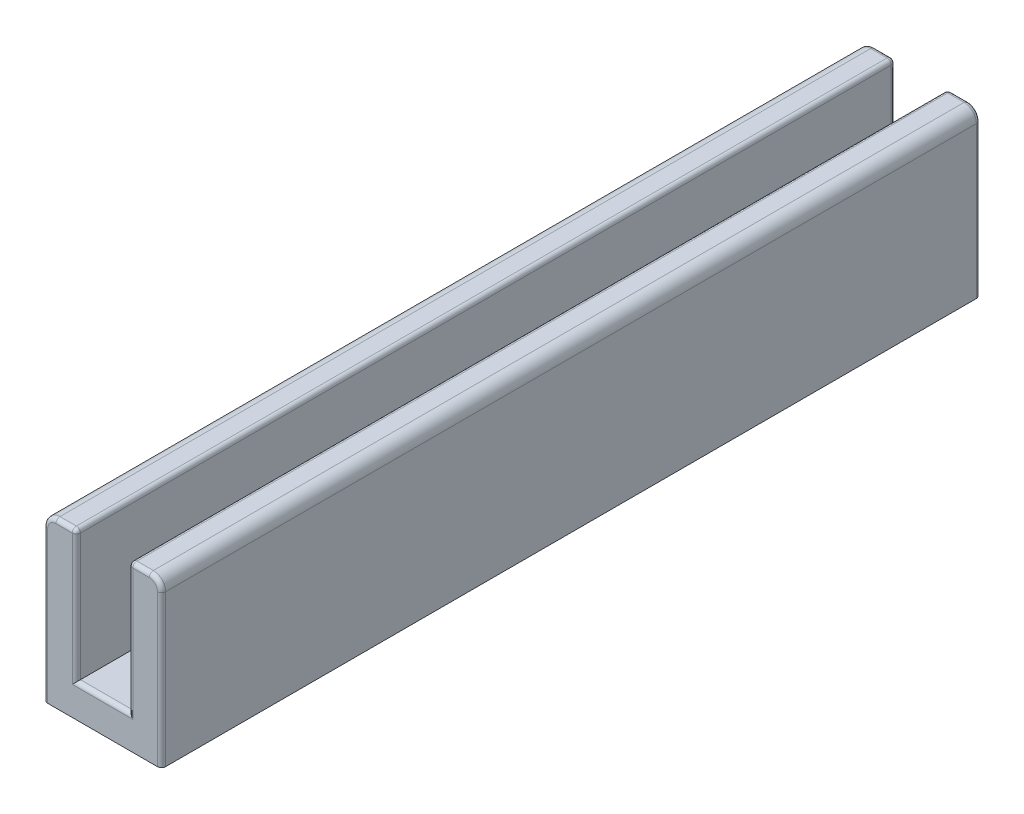
ISO-10303-21;
HEADER;
FILE_DESCRIPTION(('STEP AP214'),'2;1');
FILE_NAME('part.step','',(''),(''),'','','');
FILE_SCHEMA(('AUTOMOTIVE_DESIGN { 1 0 10303 214 1 1 1 1 }'));
ENDSEC;
DATA;
#1=APPLICATION_CONTEXT('core data for automotive mechanical design processes');
#2=APPLICATION_PROTOCOL_DEFINITION('international standard','automotive_design',2000,#1);
#3=PRODUCT_CONTEXT('',#1,'mechanical');
#4=PRODUCT('Part','Part','',(#3));
#5=PRODUCT_RELATED_PRODUCT_CATEGORY('part','',(#4));
#6=PRODUCT_DEFINITION_FORMATION('','',#4);
#7=PRODUCT_DEFINITION_CONTEXT('part definition',#1,'design');
#8=PRODUCT_DEFINITION('design','',#6,#7);
#9=PRODUCT_DEFINITION_SHAPE('','',#8);
#10=(LENGTH_UNIT() NAMED_UNIT(*) SI_UNIT(.MILLI.,.METRE.));
#11=(NAMED_UNIT(*) PLANE_ANGLE_UNIT() SI_UNIT($,.RADIAN.));
#12=(NAMED_UNIT(*) SI_UNIT($,.STERADIAN.) SOLID_ANGLE_UNIT());
#13=UNCERTAINTY_MEASURE_WITH_UNIT(LENGTH_MEASURE(1.E-05),#10,'distance_accuracy_value','');
#14=(GEOMETRIC_REPRESENTATION_CONTEXT(3) GLOBAL_UNCERTAINTY_ASSIGNED_CONTEXT((#13)) GLOBAL_UNIT_ASSIGNED_CONTEXT((#10,
#11,#12)) REPRESENTATION_CONTEXT('',''));
#15=CARTESIAN_POINT('',(0.,0.,0.));
#16=DIRECTION('',(0.,0.,1.));
#17=DIRECTION('',(1.,0.,0.));
#18=AXIS2_PLACEMENT_3D('',#15,#16,#17);
#19=CARTESIAN_POINT('',(0.,8.,50.));
#20=DIRECTION('',(-1.,0.,0.));
#21=DIRECTION('',(0.,-1.,0.));
#22=AXIS2_PLACEMENT_3D('',#19,#20,#21);
#23=PLANE('',#22);
#24=DIRECTION('',(0.,0.,-1.));
#25=VECTOR('',#24,1.);
#26=CARTESIAN_POINT('',(0.,0.,50.));
#27=LINE('',#26,#25);
#28=CARTESIAN_POINT('',(0.,0.,49.75));
#29=VERTEX_POINT('',#28);
#30=CARTESIAN_POINT('',(0.,0.,0.25));
#31=VERTEX_POINT('',#30);
#32=EDGE_CURVE('E222',#29,#31,#27,.T.);
#33=ORIENTED_EDGE('',*,*,#32,.T.);
#34=DIRECTION('',(0.,1.,0.));
#35=VECTOR('',#34,1.);
#36=CARTESIAN_POINT('',(0.,7.75,0.25));
#37=LINE('',#36,#35);
#38=CARTESIAN_POINT('',(0.,7.75,0.25));
#39=VERTEX_POINT('',#38);
#40=EDGE_CURVE('E197',#31,#39,#37,.T.);
#41=ORIENTED_EDGE('',*,*,#40,.T.);
#42=DIRECTION('',(0.,0.,-1.));
#43=VECTOR('',#42,1.);
#44=CARTESIAN_POINT('',(0.,7.75,50.));
#45=LINE('',#44,#43);
#46=CARTESIAN_POINT('',(0.,7.75,49.75));
#47=VERTEX_POINT('',#46);
#48=EDGE_CURVE('E219',#39,#47,#45,.F.);
#49=ORIENTED_EDGE('',*,*,#48,.T.);
#50=DIRECTION('',(0.,1.,0.));
#51=VECTOR('',#50,1.);
#52=CARTESIAN_POINT('',(0.,8.,49.75));
#53=LINE('',#52,#51);
#54=EDGE_CURVE('E226',#47,#29,#53,.F.);
#55=ORIENTED_EDGE('',*,*,#54,.T.);
#56=EDGE_LOOP('',(#33,#41,#49,#55));
#57=FACE_BOUND('',#56,.T.);
#58=ADVANCED_FACE('F41',(#57),#23,.F.);
#59=CARTESIAN_POINT('',(-2.,8.,50.));
#60=DIRECTION('',(0.,-1.,0.));
#61=DIRECTION('',(0.,0.,-1.));
#62=AXIS2_PLACEMENT_3D('',#59,#60,#61);
#63=PLANE('',#62);
#64=DIRECTION('',(0.,0.,-1.));
#65=VECTOR('',#64,1.);
#66=CARTESIAN_POINT('',(-0.250000000000002,8.,50.));
#67=LINE('',#66,#65);
#68=CARTESIAN_POINT('',(-0.250000000000002,8.,49.75));
#69=VERTEX_POINT('',#68);
#70=CARTESIAN_POINT('',(-0.250000000000002,8.,0.25));
#71=VERTEX_POINT('',#70);
#72=EDGE_CURVE('E232',#69,#71,#67,.T.);
#73=ORIENTED_EDGE('',*,*,#72,.T.);
#74=DIRECTION('',(-1.,0.,0.));
#75=VECTOR('',#74,1.);
#76=CARTESIAN_POINT('',(-1.25,8.,0.25));
#77=LINE('',#76,#75);
#78=CARTESIAN_POINT('',(-1.25,8.,0.25));
#79=VERTEX_POINT('',#78);
#80=EDGE_CURVE('E11',#71,#79,#77,.T.);
#81=ORIENTED_EDGE('',*,*,#80,.T.);
#82=DIRECTION('',(0.,0.,-1.));
#83=VECTOR('',#82,1.);
#84=CARTESIAN_POINT('',(-1.25,8.,50.));
#85=LINE('',#84,#83);
#86=CARTESIAN_POINT('',(-1.25,8.,49.75));
#87=VERTEX_POINT('',#86);
#88=EDGE_CURVE('E472',#79,#87,#85,.F.);
#89=ORIENTED_EDGE('',*,*,#88,.T.);
#90=DIRECTION('',(-1.,0.,0.));
#91=VECTOR('',#90,1.);
#92=CARTESIAN_POINT('',(-2.,8.,49.75));
#93=LINE('',#92,#91);
#94=EDGE_CURVE('E51',#87,#69,#93,.F.);
#95=ORIENTED_EDGE('',*,*,#94,.T.);
#96=EDGE_LOOP('',(#73,#81,#89,#95));
#97=FACE_BOUND('',#96,.T.);
#98=ADVANCED_FACE('F537',(#97),#63,.F.);
#99=CARTESIAN_POINT('',(-2.,0.,50.));
#100=DIRECTION('',(1.,0.,0.));
#101=DIRECTION('',(0.,1.,0.));
#102=AXIS2_PLACEMENT_3D('',#99,#100,#101);
#103=PLANE('',#102);
#104=DIRECTION('',(0.,0.,-1.));
#105=VECTOR('',#104,1.);
#106=CARTESIAN_POINT('',(-2.,7.25,50.));
#107=LINE('',#106,#105);
#108=CARTESIAN_POINT('',(-2.,7.25,49.75));
#109=VERTEX_POINT('',#108);
#110=CARTESIAN_POINT('',(-2.,7.25,0.25));
#111=VERTEX_POINT('',#110);
#112=EDGE_CURVE('E463',#109,#111,#107,.T.);
#113=ORIENTED_EDGE('',*,*,#112,.T.);
#114=DIRECTION('',(0.,-1.,0.));
#115=VECTOR('',#114,1.);
#116=CARTESIAN_POINT('',(-2.,-2.,0.25));
#117=LINE('',#116,#115);
#118=CARTESIAN_POINT('',(-2.,-2.,0.25));
#119=VERTEX_POINT('',#118);
#120=EDGE_CURVE('E277',#111,#119,#117,.T.);
#121=ORIENTED_EDGE('',*,*,#120,.T.);
#122=DIRECTION('',(0.,0.,-1.));
#123=VECTOR('',#122,1.);
#124=CARTESIAN_POINT('',(-2.,-2.,50.));
#125=LINE('',#124,#123);
#126=CARTESIAN_POINT('',(-2.,-2.,49.75));
#127=VERTEX_POINT('',#126);
#128=EDGE_CURVE('E458',#127,#119,#125,.T.);
#129=ORIENTED_EDGE('',*,*,#128,.F.);
#130=DIRECTION('',(0.,-1.,0.));
#131=VECTOR('',#130,1.);
#132=CARTESIAN_POINT('',(-2.,0.,49.75));
#133=LINE('',#132,#131);
#134=EDGE_CURVE('E213',#127,#109,#133,.F.);
#135=ORIENTED_EDGE('',*,*,#134,.T.);
#136=EDGE_LOOP('',(#113,#121,#129,#135));
#137=FACE_BOUND('',#136,.T.);
#138=ADVANCED_FACE('F542',(#137),#103,.F.);
#139=CARTESIAN_POINT('',(5.2,-2.,50.));
#140=DIRECTION('',(0.,1.,0.));
#141=DIRECTION('',(-1.,0.,0.));
#142=AXIS2_PLACEMENT_3D('',#139,#140,#141);
#143=PLANE('',#142);
#144=ORIENTED_EDGE('',*,*,#128,.T.);
#145=CARTESIAN_POINT('',(-1.75,-2.,0.25));
#146=DIRECTION('',(0.,1.,0.));
#147=DIRECTION('',(-1.,0.,0.));
#148=AXIS2_PLACEMENT_3D('',#145,#146,#147);
#149=CIRCLE('',#148,0.25);
#150=CARTESIAN_POINT('',(-1.75,-2.,0.));
#151=VERTEX_POINT('',#150);
#152=EDGE_CURVE('E289',#119,#151,#149,.F.);
#153=ORIENTED_EDGE('',*,*,#152,.T.);
#154=DIRECTION('',(1.,0.,0.));
#155=VECTOR('',#154,1.);
#156=CARTESIAN_POINT('',(5.2,-2.,0.));
#157=LINE('',#156,#155);
#158=CARTESIAN_POINT('',(4.95,-2.,0.));
#159=VERTEX_POINT('',#158);
#160=EDGE_CURVE('E393',#151,#159,#157,.T.);
#161=ORIENTED_EDGE('',*,*,#160,.T.);
#162=CARTESIAN_POINT('',(4.95,-2.,0.25));
#163=DIRECTION('',(0.,1.,0.));
#164=DIRECTION('',(-1.,0.,0.));
#165=AXIS2_PLACEMENT_3D('',#162,#163,#164);
#166=CIRCLE('',#165,0.25);
#167=CARTESIAN_POINT('',(5.2,-2.,0.25));
#168=VERTEX_POINT('',#167);
#169=EDGE_CURVE('E286',#159,#168,#166,.F.);
#170=ORIENTED_EDGE('',*,*,#169,.T.);
#171=DIRECTION('',(0.,0.,-1.));
#172=VECTOR('',#171,1.);
#173=CARTESIAN_POINT('',(5.2,-2.,50.));
#174=LINE('',#173,#172);
#175=CARTESIAN_POINT('',(5.2,-2.,49.75));
#176=VERTEX_POINT('',#175);
#177=EDGE_CURVE('E447',#176,#168,#174,.T.);
#178=ORIENTED_EDGE('',*,*,#177,.F.);
#179=CARTESIAN_POINT('',(4.95,-2.,49.75));
#180=DIRECTION('',(0.,1.,0.));
#181=DIRECTION('',(-1.,0.,0.));
#182=AXIS2_PLACEMENT_3D('',#179,#180,#181);
#183=CIRCLE('',#182,0.25);
#184=CARTESIAN_POINT('',(4.95,-2.,50.));
#185=VERTEX_POINT('',#184);
#186=EDGE_CURVE('E280',#176,#185,#183,.F.);
#187=ORIENTED_EDGE('',*,*,#186,.T.);
#188=DIRECTION('',(1.,0.,0.));
#189=VECTOR('',#188,1.);
#190=CARTESIAN_POINT('',(5.2,-2.,50.));
#191=LINE('',#190,#189);
#192=CARTESIAN_POINT('',(-1.75,-2.,50.));
#193=VERTEX_POINT('',#192);
#194=EDGE_CURVE('E856',#193,#185,#191,.T.);
#195=ORIENTED_EDGE('',*,*,#194,.F.);
#196=CARTESIAN_POINT('',(-1.75,-2.,49.75));
#197=DIRECTION('',(0.,1.,0.));
#198=DIRECTION('',(-1.,0.,0.));
#199=AXIS2_PLACEMENT_3D('',#196,#197,#198);
#200=CIRCLE('',#199,0.25);
#201=EDGE_CURVE('E283',#193,#127,#200,.F.);
#202=ORIENTED_EDGE('',*,*,#201,.T.);
#203=EDGE_LOOP('',(#144,#153,#161,#170,#178,#187,#195,#202));
#204=FACE_BOUND('',#203,.T.);
#205=ADVANCED_FACE('F452',(#204),#143,.F.);
#206=CARTESIAN_POINT('',(5.2,0.,50.));
#207=DIRECTION('',(-1.,0.,0.));
#208=DIRECTION('',(0.,0.,1.));
#209=AXIS2_PLACEMENT_3D('',#206,#207,#208);
#210=PLANE('',#209);
#211=ORIENTED_EDGE('',*,*,#177,.T.);
#212=DIRECTION('',(0.,1.,0.));
#213=VECTOR('',#212,1.);
#214=CARTESIAN_POINT('',(5.2,7.25,0.25));
#215=LINE('',#214,#213);
#216=CARTESIAN_POINT('',(5.2,7.25,0.25));
#217=VERTEX_POINT('',#216);
#218=EDGE_CURVE('E301',#168,#217,#215,.T.);
#219=ORIENTED_EDGE('',*,*,#218,.T.);
#220=DIRECTION('',(0.,0.,-1.));
#221=VECTOR('',#220,1.);
#222=CARTESIAN_POINT('',(5.2,7.25,50.));
#223=LINE('',#222,#221);
#224=CARTESIAN_POINT('',(5.2,7.25,49.75));
#225=VERTEX_POINT('',#224);
#226=EDGE_CURVE('E239',#217,#225,#223,.F.);
#227=ORIENTED_EDGE('',*,*,#226,.T.);
#228=DIRECTION('',(0.,1.,0.));
#229=VECTOR('',#228,1.);
#230=CARTESIAN_POINT('',(5.2,0.,49.75));
#231=LINE('',#230,#229);
#232=EDGE_CURVE('E298',#225,#176,#231,.F.);
#233=ORIENTED_EDGE('',*,*,#232,.T.);
#234=EDGE_LOOP('',(#211,#219,#227,#233));
#235=FACE_BOUND('',#234,.T.);
#236=ADVANCED_FACE('F446',(#235),#210,.F.);
#237=CARTESIAN_POINT('',(5.2,8.,50.));
#238=DIRECTION('',(0.,-1.,0.));
#239=DIRECTION('',(0.,0.,-1.));
#240=AXIS2_PLACEMENT_3D('',#237,#238,#239);
#241=PLANE('',#240);
#242=DIRECTION('',(0.,0.,-1.));
#243=VECTOR('',#242,1.);
#244=CARTESIAN_POINT('',(3.45,8.,50.));
#245=LINE('',#244,#243);
#246=CARTESIAN_POINT('',(3.45,8.,0.25));
#247=VERTEX_POINT('',#246);
#248=CARTESIAN_POINT('',(3.45,8.,49.75));
#249=VERTEX_POINT('',#248);
#250=EDGE_CURVE('E237',#247,#249,#245,.F.);
#251=ORIENTED_EDGE('',*,*,#250,.T.);
#252=DIRECTION('',(-1.,0.,0.));
#253=VECTOR('',#252,1.);
#254=CARTESIAN_POINT('',(5.2,8.,49.75));
#255=LINE('',#254,#253);
#256=CARTESIAN_POINT('',(4.45,8.,49.75));
#257=VERTEX_POINT('',#256);
#258=EDGE_CURVE('E350',#249,#257,#255,.F.);
#259=ORIENTED_EDGE('',*,*,#258,.T.);
#260=DIRECTION('',(0.,0.,-1.));
#261=VECTOR('',#260,1.);
#262=CARTESIAN_POINT('',(4.45,8.,50.));
#263=LINE('',#262,#261);
#264=CARTESIAN_POINT('',(4.45,8.,0.25));
#265=VERTEX_POINT('',#264);
#266=EDGE_CURVE('E476',#257,#265,#263,.T.);
#267=ORIENTED_EDGE('',*,*,#266,.T.);
#268=DIRECTION('',(-1.,0.,0.));
#269=VECTOR('',#268,1.);
#270=CARTESIAN_POINT('',(3.45,8.,0.25));
#271=LINE('',#270,#269);
#272=EDGE_CURVE('E347',#265,#247,#271,.T.);
#273=ORIENTED_EDGE('',*,*,#272,.T.);
#274=EDGE_LOOP('',(#251,#259,#267,#273));
#275=FACE_BOUND('',#274,.T.);
#276=ADVANCED_FACE('F483',(#275),#241,.F.);
#277=CARTESIAN_POINT('',(3.2,8.,50.));
#278=DIRECTION('',(1.,0.,0.));
#279=DIRECTION('',(0.,0.,-1.));
#280=AXIS2_PLACEMENT_3D('',#277,#278,#279);
#281=PLANE('',#280);
#282=DIRECTION('',(0.,0.,-1.));
#283=VECTOR('',#282,1.);
#284=CARTESIAN_POINT('',(3.2,7.75,50.));
#285=LINE('',#284,#283);
#286=CARTESIAN_POINT('',(3.2,7.75,49.75));
#287=VERTEX_POINT('',#286);
#288=CARTESIAN_POINT('',(3.2,7.75,0.25));
#289=VERTEX_POINT('',#288);
#290=EDGE_CURVE('E231',#287,#289,#285,.T.);
#291=ORIENTED_EDGE('',*,*,#290,.T.);
#292=DIRECTION('',(0.,-1.,0.));
#293=VECTOR('',#292,1.);
#294=CARTESIAN_POINT('',(3.2,0.,0.25));
#295=LINE('',#294,#293);
#296=CARTESIAN_POINT('',(3.2,0.,0.25));
#297=VERTEX_POINT('',#296);
#298=EDGE_CURVE('E313',#289,#297,#295,.T.);
#299=ORIENTED_EDGE('',*,*,#298,.T.);
#300=DIRECTION('',(0.,0.,-1.));
#301=VECTOR('',#300,1.);
#302=CARTESIAN_POINT('',(3.2,0.,50.));
#303=LINE('',#302,#301);
#304=CARTESIAN_POINT('',(3.2,0.,49.75));
#305=VERTEX_POINT('',#304);
#306=EDGE_CURVE('E459',#305,#297,#303,.T.);
#307=ORIENTED_EDGE('',*,*,#306,.F.);
#308=DIRECTION('',(0.,-1.,0.));
#309=VECTOR('',#308,1.);
#310=CARTESIAN_POINT('',(3.2,8.,49.75));
#311=LINE('',#310,#309);
#312=EDGE_CURVE('E310',#305,#287,#311,.F.);
#313=ORIENTED_EDGE('',*,*,#312,.T.);
#314=EDGE_LOOP('',(#291,#299,#307,#313));
#315=FACE_BOUND('',#314,.T.);
#316=ADVANCED_FACE('F505',(#315),#281,.F.);
#317=CARTESIAN_POINT('',(3.2,0.,50.));
#318=DIRECTION('',(0.,-1.,0.));
#319=DIRECTION('',(1.,0.,0.));
#320=AXIS2_PLACEMENT_3D('',#317,#318,#319);
#321=PLANE('',#320);
#322=ORIENTED_EDGE('',*,*,#306,.T.);
#323=DIRECTION('',(-1.,0.,0.));
#324=VECTOR('',#323,1.);
#325=CARTESIAN_POINT('',(0.,0.,0.25));
#326=LINE('',#325,#324);
#327=EDGE_CURVE('E356',#297,#31,#326,.T.);
#328=ORIENTED_EDGE('',*,*,#327,.T.);
#329=ORIENTED_EDGE('',*,*,#32,.F.);
#330=DIRECTION('',(-1.,0.,0.));
#331=VECTOR('',#330,1.);
#332=CARTESIAN_POINT('',(3.2,0.,49.75));
#333=LINE('',#332,#331);
#334=EDGE_CURVE('E353',#29,#305,#333,.F.);
#335=ORIENTED_EDGE('',*,*,#334,.T.);
#336=EDGE_LOOP('',(#322,#328,#329,#335));
#337=FACE_BOUND('',#336,.T.);
#338=ADVANCED_FACE('F777',(#337),#321,.F.);
#339=CARTESIAN_POINT('',(0.,0.,50.));
#340=DIRECTION('',(0.,0.,-1.));
#341=DIRECTION('',(-1.,0.,0.));
#342=AXIS2_PLACEMENT_3D('',#339,#340,#341);
#343=PLANE('',#342);
#344=CARTESIAN_POINT('',(-1.25,7.25,50.));
#345=DIRECTION('',(0.,0.,-1.));
#346=DIRECTION('',(-1.,0.,0.));
#347=AXIS2_PLACEMENT_3D('',#344,#345,#346);
#348=CIRCLE('',#347,0.5);
#349=CARTESIAN_POINT('',(-1.25,7.75,50.));
#350=VERTEX_POINT('',#349);
#351=CARTESIAN_POINT('',(-1.75,7.25,50.));
#352=VERTEX_POINT('',#351);
#353=EDGE_CURVE('E59',#350,#352,#348,.F.);
#354=ORIENTED_EDGE('',*,*,#353,.T.);
#355=DIRECTION('',(0.,-1.,0.));
#356=VECTOR('',#355,1.);
#357=CARTESIAN_POINT('',(-1.75,0.,50.));
#358=LINE('',#357,#356);
#359=EDGE_CURVE('E344',#352,#193,#358,.T.);
#360=ORIENTED_EDGE('',*,*,#359,.T.);
#361=ORIENTED_EDGE('',*,*,#194,.T.);
#362=DIRECTION('',(0.,1.,0.));
#363=VECTOR('',#362,1.);
#364=CARTESIAN_POINT('',(4.95,0.,50.));
#365=LINE('',#364,#363);
#366=CARTESIAN_POINT('',(4.95,7.25,50.));
#367=VERTEX_POINT('',#366);
#368=EDGE_CURVE('E331',#185,#367,#365,.T.);
#369=ORIENTED_EDGE('',*,*,#368,.T.);
#370=CARTESIAN_POINT('',(4.45,7.25,50.));
#371=DIRECTION('',(0.,0.,-1.));
#372=DIRECTION('',(-1.,0.,0.));
#373=AXIS2_PLACEMENT_3D('',#370,#371,#372);
#374=CIRCLE('',#373,0.5);
#375=CARTESIAN_POINT('',(4.45,7.75,50.));
#376=VERTEX_POINT('',#375);
#377=EDGE_CURVE('E322',#367,#376,#374,.F.);
#378=ORIENTED_EDGE('',*,*,#377,.T.);
#379=DIRECTION('',(-1.,0.,0.));
#380=VECTOR('',#379,1.);
#381=CARTESIAN_POINT('',(0.,7.75,50.));
#382=LINE('',#381,#380);
#383=CARTESIAN_POINT('',(3.45,7.75,50.));
#384=VERTEX_POINT('',#383);
#385=EDGE_CURVE('E325',#376,#384,#382,.T.);
#386=ORIENTED_EDGE('',*,*,#385,.T.);
#387=DIRECTION('',(0.,-1.,0.));
#388=VECTOR('',#387,1.);
#389=CARTESIAN_POINT('',(3.45,0.,50.));
#390=LINE('',#389,#388);
#391=CARTESIAN_POINT('',(3.45,-0.25,50.));
#392=VERTEX_POINT('',#391);
#393=EDGE_CURVE('E328',#384,#392,#390,.T.);
#394=ORIENTED_EDGE('',*,*,#393,.T.);
#395=DIRECTION('',(-1.,0.,0.));
#396=VECTOR('',#395,1.);
#397=CARTESIAN_POINT('',(0.,-0.25,50.));
#398=LINE('',#397,#396);
#399=CARTESIAN_POINT('',(-0.25,-0.25,50.));
#400=VERTEX_POINT('',#399);
#401=EDGE_CURVE('E334',#392,#400,#398,.T.);
#402=ORIENTED_EDGE('',*,*,#401,.T.);
#403=DIRECTION('',(0.,1.,0.));
#404=VECTOR('',#403,1.);
#405=CARTESIAN_POINT('',(-0.25,0.,50.));
#406=LINE('',#405,#404);
#407=CARTESIAN_POINT('',(-0.250000000000002,7.75,50.));
#408=VERTEX_POINT('',#407);
#409=EDGE_CURVE('E337',#400,#408,#406,.T.);
#410=ORIENTED_EDGE('',*,*,#409,.T.);
#411=DIRECTION('',(-1.,0.,0.));
#412=VECTOR('',#411,1.);
#413=CARTESIAN_POINT('',(0.,7.75,50.));
#414=LINE('',#413,#412);
#415=EDGE_CURVE('E64',#408,#350,#414,.T.);
#416=ORIENTED_EDGE('',*,*,#415,.T.);
#417=EDGE_LOOP('',(#354,#360,#361,#369,#378,#386,#394,#402,#410,#416));
#418=FACE_BOUND('',#417,.T.);
#419=ADVANCED_FACE('F519',(#418),#343,.F.);
#420=CARTESIAN_POINT('',(0.,0.,0.));
#421=DIRECTION('',(0.,0.,-1.));
#422=DIRECTION('',(-1.,0.,0.));
#423=AXIS2_PLACEMENT_3D('',#420,#421,#422);
#424=PLANE('',#423);
#425=ORIENTED_EDGE('',*,*,#160,.F.);
#426=DIRECTION('',(0.,-1.,0.));
#427=VECTOR('',#426,1.);
#428=CARTESIAN_POINT('',(-1.75,7.25,0.));
#429=LINE('',#428,#427);
#430=CARTESIAN_POINT('',(-1.75,7.25,0.));
#431=VERTEX_POINT('',#430);
#432=EDGE_CURVE('E270',#151,#431,#429,.F.);
#433=ORIENTED_EDGE('',*,*,#432,.T.);
#434=CARTESIAN_POINT('',(-1.25,7.25,0.));
#435=DIRECTION('',(0.,0.,-1.));
#436=DIRECTION('',(-1.,0.,0.));
#437=AXIS2_PLACEMENT_3D('',#434,#435,#436);
#438=CIRCLE('',#437,0.5);
#439=CARTESIAN_POINT('',(-1.25,7.75,0.));
#440=VERTEX_POINT('',#439);
#441=EDGE_CURVE('E267',#431,#440,#438,.T.);
#442=ORIENTED_EDGE('',*,*,#441,.T.);
#443=DIRECTION('',(-1.,0.,0.));
#444=VECTOR('',#443,1.);
#445=CARTESIAN_POINT('',(-0.250000000000002,7.75,0.));
#446=LINE('',#445,#444);
#447=CARTESIAN_POINT('',(-0.250000000000002,7.75,0.));
#448=VERTEX_POINT('',#447);
#449=EDGE_CURVE('E264',#440,#448,#446,.F.);
#450=ORIENTED_EDGE('',*,*,#449,.T.);
#451=DIRECTION('',(0.,1.,0.));
#452=VECTOR('',#451,1.);
#453=CARTESIAN_POINT('',(-0.25,0.,0.));
#454=LINE('',#453,#452);
#455=CARTESIAN_POINT('',(-0.25,-0.25,0.));
#456=VERTEX_POINT('',#455);
#457=EDGE_CURVE('E198',#448,#456,#454,.F.);
#458=ORIENTED_EDGE('',*,*,#457,.T.);
#459=DIRECTION('',(-1.,0.,0.));
#460=VECTOR('',#459,1.);
#461=CARTESIAN_POINT('',(3.2,-0.25,0.));
#462=LINE('',#461,#460);
#463=CARTESIAN_POINT('',(3.45,-0.25,0.));
#464=VERTEX_POINT('',#463);
#465=EDGE_CURVE('E259',#456,#464,#462,.F.);
#466=ORIENTED_EDGE('',*,*,#465,.T.);
#467=DIRECTION('',(0.,-1.,0.));
#468=VECTOR('',#467,1.);
#469=CARTESIAN_POINT('',(3.45,7.75,0.));
#470=LINE('',#469,#468);
#471=CARTESIAN_POINT('',(3.45,7.75,0.));
#472=VERTEX_POINT('',#471);
#473=EDGE_CURVE('E250',#464,#472,#470,.F.);
#474=ORIENTED_EDGE('',*,*,#473,.T.);
#475=DIRECTION('',(-1.,0.,0.));
#476=VECTOR('',#475,1.);
#477=CARTESIAN_POINT('',(4.45,7.75,0.));
#478=LINE('',#477,#476);
#479=CARTESIAN_POINT('',(4.45,7.75,0.));
#480=VERTEX_POINT('',#479);
#481=EDGE_CURVE('E225',#472,#480,#478,.F.);
#482=ORIENTED_EDGE('',*,*,#481,.T.);
#483=CARTESIAN_POINT('',(4.45,7.25,0.));
#484=DIRECTION('',(0.,0.,-1.));
#485=DIRECTION('',(-1.,0.,0.));
#486=AXIS2_PLACEMENT_3D('',#483,#484,#485);
#487=CIRCLE('',#486,0.5);
#488=CARTESIAN_POINT('',(4.95,7.25,0.));
#489=VERTEX_POINT('',#488);
#490=EDGE_CURVE('E253',#480,#489,#487,.T.);
#491=ORIENTED_EDGE('',*,*,#490,.T.);
#492=DIRECTION('',(0.,1.,0.));
#493=VECTOR('',#492,1.);
#494=CARTESIAN_POINT('',(4.95,-2.,0.));
#495=LINE('',#494,#493);
#496=EDGE_CURVE('E256',#489,#159,#495,.F.);
#497=ORIENTED_EDGE('',*,*,#496,.T.);
#498=EDGE_LOOP('',(#425,#433,#442,#450,#458,#466,#474,#482,#491,#497));
#499=FACE_BOUND('',#498,.T.);
#500=ADVANCED_FACE('F551',(#499),#424,.T.);
#501=CARTESIAN_POINT('',(-1.25,7.25,50.));
#502=DIRECTION('',(0.,0.,-1.));
#503=DIRECTION('',(-1.,0.,0.));
#504=AXIS2_PLACEMENT_3D('',#501,#502,#503);
#505=CYLINDRICAL_SURFACE('',#504,0.75);
#506=ORIENTED_EDGE('',*,*,#88,.F.);
#507=CARTESIAN_POINT('',(-1.25,7.25,0.25));
#508=DIRECTION('',(0.,0.,-1.));
#509=DIRECTION('',(-1.,0.,0.));
#510=AXIS2_PLACEMENT_3D('',#507,#508,#509);
#511=CIRCLE('',#510,0.75);
#512=EDGE_CURVE('E295',#79,#111,#511,.F.);
#513=ORIENTED_EDGE('',*,*,#512,.T.);
#514=ORIENTED_EDGE('',*,*,#112,.F.);
#515=CARTESIAN_POINT('',(-1.25,7.25,49.75));
#516=DIRECTION('',(0.,0.,-1.));
#517=DIRECTION('',(-1.,0.,0.));
#518=AXIS2_PLACEMENT_3D('',#515,#516,#517);
#519=CIRCLE('',#518,0.75);
#520=EDGE_CURVE('E292',#109,#87,#519,.T.);
#521=ORIENTED_EDGE('',*,*,#520,.T.);
#522=EDGE_LOOP('',(#506,#513,#514,#521));
#523=FACE_BOUND('',#522,.T.);
#524=ADVANCED_FACE('F547',(#523),#505,.T.);
#525=CARTESIAN_POINT('',(4.45,7.25,50.));
#526=DIRECTION('',(0.,0.,-1.));
#527=DIRECTION('',(-1.,0.,0.));
#528=AXIS2_PLACEMENT_3D('',#525,#526,#527);
#529=CYLINDRICAL_SURFACE('',#528,0.75);
#530=ORIENTED_EDGE('',*,*,#226,.F.);
#531=CARTESIAN_POINT('',(4.45,7.25,0.25));
#532=DIRECTION('',(0.,0.,-1.));
#533=DIRECTION('',(-1.,0.,0.));
#534=AXIS2_PLACEMENT_3D('',#531,#532,#533);
#535=CIRCLE('',#534,0.75);
#536=EDGE_CURVE('E307',#217,#265,#535,.F.);
#537=ORIENTED_EDGE('',*,*,#536,.T.);
#538=ORIENTED_EDGE('',*,*,#266,.F.);
#539=CARTESIAN_POINT('',(4.45,7.25,49.75));
#540=DIRECTION('',(0.,0.,-1.));
#541=DIRECTION('',(-1.,0.,0.));
#542=AXIS2_PLACEMENT_3D('',#539,#540,#541);
#543=CIRCLE('',#542,0.75);
#544=EDGE_CURVE('E304',#257,#225,#543,.T.);
#545=ORIENTED_EDGE('',*,*,#544,.T.);
#546=EDGE_LOOP('',(#530,#537,#538,#545));
#547=FACE_BOUND('',#546,.T.);
#548=ADVANCED_FACE('F550',(#547),#529,.T.);
#549=CARTESIAN_POINT('',(-0.250000000000002,7.75,50.));
#550=DIRECTION('',(0.,0.,-1.));
#551=DIRECTION('',(-1.,0.,0.));
#552=AXIS2_PLACEMENT_3D('',#549,#550,#551);
#553=CYLINDRICAL_SURFACE('',#552,0.25);
#554=ORIENTED_EDGE('',*,*,#48,.F.);
#555=CARTESIAN_POINT('',(-0.250000000000002,7.75,0.25));
#556=DIRECTION('',(0.,0.,-1.));
#557=DIRECTION('',(-1.,0.,0.));
#558=AXIS2_PLACEMENT_3D('',#555,#556,#557);
#559=CIRCLE('',#558,0.25);
#560=EDGE_CURVE('E204',#39,#71,#559,.F.);
#561=ORIENTED_EDGE('',*,*,#560,.T.);
#562=ORIENTED_EDGE('',*,*,#72,.F.);
#563=CARTESIAN_POINT('',(-0.250000000000002,7.75,49.75));
#564=DIRECTION('',(0.,0.,-1.));
#565=DIRECTION('',(-1.,0.,0.));
#566=AXIS2_PLACEMENT_3D('',#563,#564,#565);
#567=CIRCLE('',#566,0.25);
#568=EDGE_CURVE('E214',#69,#47,#567,.T.);
#569=ORIENTED_EDGE('',*,*,#568,.T.);
#570=EDGE_LOOP('',(#554,#561,#562,#569));
#571=FACE_BOUND('',#570,.T.);
#572=ADVANCED_FACE('F228',(#571),#553,.T.);
#573=CARTESIAN_POINT('',(3.45,7.75,50.));
#574=DIRECTION('',(0.,0.,-1.));
#575=DIRECTION('',(-1.,0.,0.));
#576=AXIS2_PLACEMENT_3D('',#573,#574,#575);
#577=CYLINDRICAL_SURFACE('',#576,0.25);
#578=ORIENTED_EDGE('',*,*,#250,.F.);
#579=CARTESIAN_POINT('',(3.45,7.75,0.25));
#580=DIRECTION('',(0.,0.,-1.));
#581=DIRECTION('',(-1.,0.,0.));
#582=AXIS2_PLACEMENT_3D('',#579,#580,#581);
#583=CIRCLE('',#582,0.25);
#584=EDGE_CURVE('E319',#247,#289,#583,.F.);
#585=ORIENTED_EDGE('',*,*,#584,.T.);
#586=ORIENTED_EDGE('',*,*,#290,.F.);
#587=CARTESIAN_POINT('',(3.45,7.75,49.75));
#588=DIRECTION('',(0.,0.,-1.));
#589=DIRECTION('',(-1.,0.,0.));
#590=AXIS2_PLACEMENT_3D('',#587,#588,#589);
#591=CIRCLE('',#590,0.25);
#592=EDGE_CURVE('E316',#287,#249,#591,.T.);
#593=ORIENTED_EDGE('',*,*,#592,.T.);
#594=EDGE_LOOP('',(#578,#585,#586,#593));
#595=FACE_BOUND('',#594,.T.);
#596=ADVANCED_FACE('F502',(#595),#577,.T.);
#597=CARTESIAN_POINT('',(4.95,0.,0.25));
#598=DIRECTION('',(0.,-1.,0.));
#599=DIRECTION('',(0.,0.,-1.));
#600=AXIS2_PLACEMENT_3D('',#597,#598,#599);
#601=CYLINDRICAL_SURFACE('',#600,0.25);
#602=ORIENTED_EDGE('',*,*,#169,.F.);
#603=ORIENTED_EDGE('',*,*,#496,.F.);
#604=CARTESIAN_POINT('',(4.95,7.25,0.25));
#605=DIRECTION('',(0.,1.,0.));
#606=DIRECTION('',(0.,0.,1.));
#607=AXIS2_PLACEMENT_3D('',#604,#605,#606);
#608=CIRCLE('',#607,0.25);
#609=EDGE_CURVE('E389',#217,#489,#608,.T.);
#610=ORIENTED_EDGE('',*,*,#609,.F.);
#611=ORIENTED_EDGE('',*,*,#218,.F.);
#612=EDGE_LOOP('',(#602,#603,#610,#611));
#613=FACE_BOUND('',#612,.T.);
#614=ADVANCED_FACE('F559',(#613),#601,.T.);
#615=CARTESIAN_POINT('',(4.45,7.25,0.25));
#616=DIRECTION('',(0.,0.,-1.));
#617=DIRECTION('',(-1.,0.,0.));
#618=AXIS2_PLACEMENT_3D('',#615,#616,#617);
#619=TOROIDAL_SURFACE('',#618,0.5,0.25);
#620=ORIENTED_EDGE('',*,*,#609,.T.);
#621=ORIENTED_EDGE('',*,*,#490,.F.);
#622=CARTESIAN_POINT('',(4.45,7.75,0.25));
#623=DIRECTION('',(-1.,0.,0.));
#624=DIRECTION('',(0.,0.,1.));
#625=AXIS2_PLACEMENT_3D('',#622,#623,#624);
#626=CIRCLE('',#625,0.25);
#627=EDGE_CURVE('E385',#265,#480,#626,.T.);
#628=ORIENTED_EDGE('',*,*,#627,.F.);
#629=ORIENTED_EDGE('',*,*,#536,.F.);
#630=EDGE_LOOP('',(#620,#621,#628,#629));
#631=FACE_BOUND('',#630,.T.);
#632=ADVANCED_FACE('F490',(#631),#619,.T.);
#633=CARTESIAN_POINT('',(5.2,7.75,0.25));
#634=DIRECTION('',(1.,0.,0.));
#635=DIRECTION('',(0.,0.,-1.));
#636=AXIS2_PLACEMENT_3D('',#633,#634,#635);
#637=CYLINDRICAL_SURFACE('',#636,0.25);
#638=ORIENTED_EDGE('',*,*,#627,.T.);
#639=ORIENTED_EDGE('',*,*,#481,.F.);
#640=CARTESIAN_POINT('',(3.45,7.75,0.25));
#641=DIRECTION('',(-1.,0.,0.));
#642=DIRECTION('',(0.,0.,1.));
#643=AXIS2_PLACEMENT_3D('',#640,#641,#642);
#644=CIRCLE('',#643,0.25);
#645=EDGE_CURVE('E381',#247,#472,#644,.T.);
#646=ORIENTED_EDGE('',*,*,#645,.F.);
#647=ORIENTED_EDGE('',*,*,#272,.F.);
#648=EDGE_LOOP('',(#638,#639,#646,#647));
#649=FACE_BOUND('',#648,.T.);
#650=ADVANCED_FACE('F494',(#649),#637,.T.);
#651=CARTESIAN_POINT('',(-1.75,0.,0.25));
#652=DIRECTION('',(0.,1.,0.));
#653=DIRECTION('',(-1.,0.,0.));
#654=AXIS2_PLACEMENT_3D('',#651,#652,#653);
#655=CYLINDRICAL_SURFACE('',#654,0.25);
#656=ORIENTED_EDGE('',*,*,#152,.F.);
#657=ORIENTED_EDGE('',*,*,#120,.F.);
#658=CARTESIAN_POINT('',(-1.75,7.25,0.25));
#659=DIRECTION('',(0.,1.,0.));
#660=DIRECTION('',(0.,0.,1.));
#661=AXIS2_PLACEMENT_3D('',#658,#659,#660);
#662=CIRCLE('',#661,0.25);
#663=EDGE_CURVE('E377',#431,#111,#662,.T.);
#664=ORIENTED_EDGE('',*,*,#663,.F.);
#665=ORIENTED_EDGE('',*,*,#432,.F.);
#666=EDGE_LOOP('',(#656,#657,#664,#665));
#667=FACE_BOUND('',#666,.T.);
#668=ADVANCED_FACE('F582',(#667),#655,.T.);
#669=CARTESIAN_POINT('',(3.45,7.75,0.25));
#670=DIRECTION('',(0.,0.,-1.));
#671=DIRECTION('',(-1.,0.,0.));
#672=AXIS2_PLACEMENT_3D('',#669,#670,#671);
#673=SPHERICAL_SURFACE('',#672,0.25);
#674=ORIENTED_EDGE('',*,*,#584,.F.);
#675=ORIENTED_EDGE('',*,*,#645,.T.);
#676=CARTESIAN_POINT('',(3.45,7.75,0.25));
#677=DIRECTION('',(0.,-1.,0.));
#678=DIRECTION('',(0.,0.,-1.));
#679=AXIS2_PLACEMENT_3D('',#676,#677,#678);
#680=CIRCLE('',#679,0.25);
#681=EDGE_CURVE('E373',#289,#472,#680,.T.);
#682=ORIENTED_EDGE('',*,*,#681,.F.);
#683=EDGE_LOOP('',(#674,#675,#682));
#684=FACE_BOUND('',#683,.T.);
#685=ADVANCED_FACE('F498',(#684),#673,.T.);
#686=CARTESIAN_POINT('',(-1.25,7.25,0.25));
#687=DIRECTION('',(0.,0.,-1.));
#688=DIRECTION('',(-1.,0.,0.));
#689=AXIS2_PLACEMENT_3D('',#686,#687,#688);
#690=TOROIDAL_SURFACE('',#689,0.5,0.25);
#691=ORIENTED_EDGE('',*,*,#663,.T.);
#692=ORIENTED_EDGE('',*,*,#512,.F.);
#693=CARTESIAN_POINT('',(-1.25,7.75,0.25));
#694=DIRECTION('',(1.,0.,0.));
#695=DIRECTION('',(0.,0.,-1.));
#696=AXIS2_PLACEMENT_3D('',#693,#694,#695);
#697=CIRCLE('',#696,0.25);
#698=EDGE_CURVE('E369',#440,#79,#697,.T.);
#699=ORIENTED_EDGE('',*,*,#698,.F.);
#700=ORIENTED_EDGE('',*,*,#441,.F.);
#701=EDGE_LOOP('',(#691,#692,#699,#700));
#702=FACE_BOUND('',#701,.T.);
#703=ADVANCED_FACE('F575',(#702),#690,.T.);
#704=CARTESIAN_POINT('',(3.45,8.,0.25));
#705=DIRECTION('',(0.,1.,0.));
#706=DIRECTION('',(0.,0.,1.));
#707=AXIS2_PLACEMENT_3D('',#704,#705,#706);
#708=CYLINDRICAL_SURFACE('',#707,0.25);
#709=ORIENTED_EDGE('',*,*,#681,.T.);
#710=ORIENTED_EDGE('',*,*,#473,.F.);
#711=CARTESIAN_POINT('',(3.45,-0.25,0.25));
#712=DIRECTION('',(0.707106781186547,0.707106781186547,0.));
#713=DIRECTION('',(-0.707106781186548,0.707106781186547,0.));
#714=AXIS2_PLACEMENT_3D('',#711,#712,#713);
#715=ELLIPSE('',#714,0.353553390593274,0.25);
#716=EDGE_CURVE('E365',#297,#464,#715,.F.);
#717=ORIENTED_EDGE('',*,*,#716,.F.);
#718=ORIENTED_EDGE('',*,*,#298,.F.);
#719=EDGE_LOOP('',(#709,#710,#717,#718));
#720=FACE_BOUND('',#719,.T.);
#721=ADVANCED_FACE('F571',(#720),#708,.T.);
#722=CARTESIAN_POINT('',(-2.,7.75,0.25));
#723=DIRECTION('',(1.,0.,0.));
#724=DIRECTION('',(0.,0.,-1.));
#725=AXIS2_PLACEMENT_3D('',#722,#723,#724);
#726=CYLINDRICAL_SURFACE('',#725,0.25);
#727=ORIENTED_EDGE('',*,*,#698,.T.);
#728=ORIENTED_EDGE('',*,*,#80,.F.);
#729=CARTESIAN_POINT('',(-0.250000000000002,7.75,0.25));
#730=DIRECTION('',(1.,0.,0.));
#731=DIRECTION('',(0.,0.,-1.));
#732=AXIS2_PLACEMENT_3D('',#729,#730,#731);
#733=CIRCLE('',#732,0.25);
#734=EDGE_CURVE('E207',#448,#71,#733,.T.);
#735=ORIENTED_EDGE('',*,*,#734,.F.);
#736=ORIENTED_EDGE('',*,*,#449,.F.);
#737=EDGE_LOOP('',(#727,#728,#735,#736));
#738=FACE_BOUND('',#737,.T.);
#739=ADVANCED_FACE('F567',(#738),#726,.T.);
#740=CARTESIAN_POINT('',(3.2,-0.25,0.25));
#741=DIRECTION('',(1.,0.,0.));
#742=DIRECTION('',(0.,1.,0.));
#743=AXIS2_PLACEMENT_3D('',#740,#741,#742);
#744=CYLINDRICAL_SURFACE('',#743,0.25);
#745=ORIENTED_EDGE('',*,*,#716,.T.);
#746=ORIENTED_EDGE('',*,*,#465,.F.);
#747=CARTESIAN_POINT('',(-0.25,-0.25,0.25));
#748=DIRECTION('',(0.707106781186548,-0.707106781186547,0.));
#749=DIRECTION('',(-0.707106781186547,-0.707106781186548,0.));
#750=AXIS2_PLACEMENT_3D('',#747,#748,#749);
#751=ELLIPSE('',#750,0.353553390593274,0.25);
#752=EDGE_CURVE('E202',#31,#456,#751,.F.);
#753=ORIENTED_EDGE('',*,*,#752,.F.);
#754=ORIENTED_EDGE('',*,*,#327,.F.);
#755=EDGE_LOOP('',(#745,#746,#753,#754));
#756=FACE_BOUND('',#755,.T.);
#757=ADVANCED_FACE('F564',(#756),#744,.T.);
#758=CARTESIAN_POINT('',(-0.250000000000002,7.75,0.25));
#759=DIRECTION('',(0.,0.,-1.));
#760=DIRECTION('',(-1.,0.,0.));
#761=AXIS2_PLACEMENT_3D('',#758,#759,#760);
#762=SPHERICAL_SURFACE('',#761,0.25);
#763=ORIENTED_EDGE('',*,*,#734,.T.);
#764=ORIENTED_EDGE('',*,*,#560,.F.);
#765=CARTESIAN_POINT('',(-0.250000000000002,7.75,0.25));
#766=DIRECTION('',(0.,-1.,0.));
#767=DIRECTION('',(0.,0.,-1.));
#768=AXIS2_PLACEMENT_3D('',#765,#766,#767);
#769=CIRCLE('',#768,0.25);
#770=EDGE_CURVE('E192',#448,#39,#769,.T.);
#771=ORIENTED_EDGE('',*,*,#770,.F.);
#772=EDGE_LOOP('',(#763,#764,#771));
#773=FACE_BOUND('',#772,.T.);
#774=ADVANCED_FACE('F205',(#773),#762,.T.);
#775=CARTESIAN_POINT('',(-0.250000000000002,8.,0.25));
#776=DIRECTION('',(0.,-1.,0.));
#777=DIRECTION('',(1.,0.,0.));
#778=AXIS2_PLACEMENT_3D('',#775,#776,#777);
#779=CYLINDRICAL_SURFACE('',#778,0.25);
#780=ORIENTED_EDGE('',*,*,#752,.T.);
#781=ORIENTED_EDGE('',*,*,#457,.F.);
#782=ORIENTED_EDGE('',*,*,#770,.T.);
#783=ORIENTED_EDGE('',*,*,#40,.F.);
#784=EDGE_LOOP('',(#780,#781,#782,#783));
#785=FACE_BOUND('',#784,.T.);
#786=ADVANCED_FACE('F195',(#785),#779,.T.);
#787=CARTESIAN_POINT('',(4.95,0.,49.75));
#788=DIRECTION('',(0.,1.,0.));
#789=DIRECTION('',(0.,0.,1.));
#790=AXIS2_PLACEMENT_3D('',#787,#788,#789);
#791=CYLINDRICAL_SURFACE('',#790,0.25);
#792=ORIENTED_EDGE('',*,*,#186,.F.);
#793=ORIENTED_EDGE('',*,*,#232,.F.);
#794=CARTESIAN_POINT('',(4.95,7.25,49.75));
#795=DIRECTION('',(0.,1.,0.));
#796=DIRECTION('',(0.,0.,1.));
#797=AXIS2_PLACEMENT_3D('',#794,#795,#796);
#798=CIRCLE('',#797,0.25);
#799=EDGE_CURVE('E45',#367,#225,#798,.T.);
#800=ORIENTED_EDGE('',*,*,#799,.F.);
#801=ORIENTED_EDGE('',*,*,#368,.F.);
#802=EDGE_LOOP('',(#792,#793,#800,#801));
#803=FACE_BOUND('',#802,.T.);
#804=ADVANCED_FACE('F43',(#803),#791,.T.);
#805=CARTESIAN_POINT('',(4.45,7.25,49.75));
#806=DIRECTION('',(0.,0.,-1.));
#807=DIRECTION('',(-1.,0.,0.));
#808=AXIS2_PLACEMENT_3D('',#805,#806,#807);
#809=TOROIDAL_SURFACE('',#808,0.5,0.25);
#810=ORIENTED_EDGE('',*,*,#799,.T.);
#811=ORIENTED_EDGE('',*,*,#544,.F.);
#812=CARTESIAN_POINT('',(4.45,7.75,49.75));
#813=DIRECTION('',(-1.,0.,0.));
#814=DIRECTION('',(0.,0.,1.));
#815=AXIS2_PLACEMENT_3D('',#812,#813,#814);
#816=CIRCLE('',#815,0.25);
#817=EDGE_CURVE('E424',#376,#257,#816,.T.);
#818=ORIENTED_EDGE('',*,*,#817,.F.);
#819=ORIENTED_EDGE('',*,*,#377,.F.);
#820=EDGE_LOOP('',(#810,#811,#818,#819));
#821=FACE_BOUND('',#820,.T.);
#822=ADVANCED_FACE('F437',(#821),#809,.T.);
#823=CARTESIAN_POINT('',(0.,7.75,49.75));
#824=DIRECTION('',(-1.,0.,0.));
#825=DIRECTION('',(0.,0.,1.));
#826=AXIS2_PLACEMENT_3D('',#823,#824,#825);
#827=CYLINDRICAL_SURFACE('',#826,0.25);
#828=ORIENTED_EDGE('',*,*,#817,.T.);
#829=ORIENTED_EDGE('',*,*,#258,.F.);
#830=CARTESIAN_POINT('',(3.45,7.75,49.75));
#831=DIRECTION('',(-1.,0.,0.));
#832=DIRECTION('',(0.,0.,1.));
#833=AXIS2_PLACEMENT_3D('',#830,#831,#832);
#834=CIRCLE('',#833,0.25);
#835=EDGE_CURVE('E421',#384,#249,#834,.T.);
#836=ORIENTED_EDGE('',*,*,#835,.F.);
#837=ORIENTED_EDGE('',*,*,#385,.F.);
#838=EDGE_LOOP('',(#828,#829,#836,#837));
#839=FACE_BOUND('',#838,.T.);
#840=ADVANCED_FACE('F521',(#839),#827,.T.);
#841=CARTESIAN_POINT('',(-1.75,0.,49.75));
#842=DIRECTION('',(0.,-1.,0.));
#843=DIRECTION('',(1.,0.,0.));
#844=AXIS2_PLACEMENT_3D('',#841,#842,#843);
#845=CYLINDRICAL_SURFACE('',#844,0.25);
#846=ORIENTED_EDGE('',*,*,#201,.F.);
#847=ORIENTED_EDGE('',*,*,#359,.F.);
#848=CARTESIAN_POINT('',(-1.75,7.25,49.75));
#849=DIRECTION('',(0.,1.,0.));
#850=DIRECTION('',(0.,0.,1.));
#851=AXIS2_PLACEMENT_3D('',#848,#849,#850);
#852=CIRCLE('',#851,0.25);
#853=EDGE_CURVE('E417',#109,#352,#852,.T.);
#854=ORIENTED_EDGE('',*,*,#853,.F.);
#855=ORIENTED_EDGE('',*,*,#134,.F.);
#856=EDGE_LOOP('',(#846,#847,#854,#855));
#857=FACE_BOUND('',#856,.T.);
#858=ADVANCED_FACE('F526',(#857),#845,.T.);
#859=CARTESIAN_POINT('',(3.45,7.75,49.75));
#860=DIRECTION('',(0.,0.,-1.));
#861=DIRECTION('',(-1.,0.,0.));
#862=AXIS2_PLACEMENT_3D('',#859,#860,#861);
#863=SPHERICAL_SURFACE('',#862,0.25);
#864=ORIENTED_EDGE('',*,*,#835,.T.);
#865=ORIENTED_EDGE('',*,*,#592,.F.);
#866=CARTESIAN_POINT('',(3.45,7.75,49.75));
#867=DIRECTION('',(0.,-1.,0.));
#868=DIRECTION('',(0.,0.,-1.));
#869=AXIS2_PLACEMENT_3D('',#866,#867,#868);
#870=CIRCLE('',#869,0.25);
#871=EDGE_CURVE('E413',#384,#287,#870,.T.);
#872=ORIENTED_EDGE('',*,*,#871,.F.);
#873=EDGE_LOOP('',(#864,#865,#872));
#874=FACE_BOUND('',#873,.T.);
#875=ADVANCED_FACE('F523',(#874),#863,.T.);
#876=CARTESIAN_POINT('',(-1.25,7.25,49.75));
#877=DIRECTION('',(0.,0.,-1.));
#878=DIRECTION('',(-1.,0.,0.));
#879=AXIS2_PLACEMENT_3D('',#876,#877,#878);
#880=TOROIDAL_SURFACE('',#879,0.5,0.25);
#881=ORIENTED_EDGE('',*,*,#853,.T.);
#882=ORIENTED_EDGE('',*,*,#353,.F.);
#883=CARTESIAN_POINT('',(-1.25,7.75,49.75));
#884=DIRECTION('',(1.,0.,0.));
#885=DIRECTION('',(0.,0.,-1.));
#886=AXIS2_PLACEMENT_3D('',#883,#884,#885);
#887=CIRCLE('',#886,0.25);
#888=EDGE_CURVE('E409',#87,#350,#887,.T.);
#889=ORIENTED_EDGE('',*,*,#888,.F.);
#890=ORIENTED_EDGE('',*,*,#520,.F.);
#891=EDGE_LOOP('',(#881,#882,#889,#890));
#892=FACE_BOUND('',#891,.T.);
#893=ADVANCED_FACE('F525',(#892),#880,.T.);
#894=CARTESIAN_POINT('',(3.45,0.,49.75));
#895=DIRECTION('',(0.,-1.,0.));
#896=DIRECTION('',(0.,0.,-1.));
#897=AXIS2_PLACEMENT_3D('',#894,#895,#896);
#898=CYLINDRICAL_SURFACE('',#897,0.25);
#899=ORIENTED_EDGE('',*,*,#871,.T.);
#900=ORIENTED_EDGE('',*,*,#312,.F.);
#901=CARTESIAN_POINT('',(3.45,-0.25,49.75));
#902=DIRECTION('',(-0.707106781186547,-0.707106781186547,0.));
#903=DIRECTION('',(0.707106781186548,-0.707106781186547,0.));
#904=AXIS2_PLACEMENT_3D('',#901,#902,#903);
#905=ELLIPSE('',#904,0.353553390593274,0.25);
#906=EDGE_CURVE('E405',#392,#305,#905,.T.);
#907=ORIENTED_EDGE('',*,*,#906,.F.);
#908=ORIENTED_EDGE('',*,*,#393,.F.);
#909=EDGE_LOOP('',(#899,#900,#907,#908));
#910=FACE_BOUND('',#909,.T.);
#911=ADVANCED_FACE('F510',(#910),#898,.T.);
#912=CARTESIAN_POINT('',(0.,7.75,49.75));
#913=DIRECTION('',(-1.,0.,0.));
#914=DIRECTION('',(0.,0.,1.));
#915=AXIS2_PLACEMENT_3D('',#912,#913,#914);
#916=CYLINDRICAL_SURFACE('',#915,0.25);
#917=ORIENTED_EDGE('',*,*,#888,.T.);
#918=ORIENTED_EDGE('',*,*,#415,.F.);
#919=CARTESIAN_POINT('',(-0.250000000000002,7.75,49.75));
#920=DIRECTION('',(1.,0.,0.));
#921=DIRECTION('',(0.,0.,-1.));
#922=AXIS2_PLACEMENT_3D('',#919,#920,#921);
#923=CIRCLE('',#922,0.25);
#924=EDGE_CURVE('E401',#69,#408,#923,.T.);
#925=ORIENTED_EDGE('',*,*,#924,.F.);
#926=ORIENTED_EDGE('',*,*,#94,.F.);
#927=EDGE_LOOP('',(#917,#918,#925,#926));
#928=FACE_BOUND('',#927,.T.);
#929=ADVANCED_FACE('F603',(#928),#916,.T.);
#930=CARTESIAN_POINT('',(0.,-0.25,49.75));
#931=DIRECTION('',(-1.,0.,0.));
#932=DIRECTION('',(0.,-1.,0.));
#933=AXIS2_PLACEMENT_3D('',#930,#931,#932);
#934=CYLINDRICAL_SURFACE('',#933,0.25);
#935=ORIENTED_EDGE('',*,*,#906,.T.);
#936=ORIENTED_EDGE('',*,*,#334,.F.);
#937=CARTESIAN_POINT('',(-0.25,-0.25,49.75));
#938=DIRECTION('',(-0.707106781186548,0.707106781186547,0.));
#939=DIRECTION('',(0.707106781186547,0.707106781186548,0.));
#940=AXIS2_PLACEMENT_3D('',#937,#938,#939);
#941=ELLIPSE('',#940,0.353553390593274,0.25);
#942=EDGE_CURVE('E397',#400,#29,#941,.T.);
#943=ORIENTED_EDGE('',*,*,#942,.F.);
#944=ORIENTED_EDGE('',*,*,#401,.F.);
#945=EDGE_LOOP('',(#935,#936,#943,#944));
#946=FACE_BOUND('',#945,.T.);
#947=ADVANCED_FACE('F516',(#946),#934,.T.);
#948=CARTESIAN_POINT('',(-0.250000000000002,7.75,49.75));
#949=DIRECTION('',(0.,0.,-1.));
#950=DIRECTION('',(-1.,0.,0.));
#951=AXIS2_PLACEMENT_3D('',#948,#949,#950);
#952=SPHERICAL_SURFACE('',#951,0.25);
#953=ORIENTED_EDGE('',*,*,#568,.F.);
#954=ORIENTED_EDGE('',*,*,#924,.T.);
#955=CARTESIAN_POINT('',(-0.250000000000002,7.75,49.75));
#956=DIRECTION('',(0.,-1.,0.));
#957=DIRECTION('',(0.,0.,-1.));
#958=AXIS2_PLACEMENT_3D('',#955,#956,#957);
#959=CIRCLE('',#958,0.25);
#960=EDGE_CURVE('E394',#47,#408,#959,.T.);
#961=ORIENTED_EDGE('',*,*,#960,.F.);
#962=EDGE_LOOP('',(#953,#954,#961));
#963=FACE_BOUND('',#962,.T.);
#964=ADVANCED_FACE('F596',(#963),#952,.T.);
#965=CARTESIAN_POINT('',(-0.25,0.,49.75));
#966=DIRECTION('',(0.,1.,0.));
#967=DIRECTION('',(-1.,0.,0.));
#968=AXIS2_PLACEMENT_3D('',#965,#966,#967);
#969=CYLINDRICAL_SURFACE('',#968,0.25);
#970=ORIENTED_EDGE('',*,*,#942,.T.);
#971=ORIENTED_EDGE('',*,*,#54,.F.);
#972=ORIENTED_EDGE('',*,*,#960,.T.);
#973=ORIENTED_EDGE('',*,*,#409,.F.);
#974=EDGE_LOOP('',(#970,#971,#972,#973));
#975=FACE_BOUND('',#974,.T.);
#976=ADVANCED_FACE('F593',(#975),#969,.T.);
#977=CLOSED_SHELL('',(#58,#98,#138,#205,#236,#276,#316,#338,#419,#500,#524,#548,#572,#596,#614,
#632,#650,#668,#685,#703,#721,#739,#757,#774,#786,#804,#822,#840,#858,#875,#893,#911,#929,#947,
#964,#976));
#978=MANIFOLD_SOLID_BREP('B2',#977);
#979=ADVANCED_BREP_SHAPE_REPRESENTATION('',(#18,#978),#14);
#980=SHAPE_DEFINITION_REPRESENTATION(#9,#979);
ENDSEC;
END-ISO-10303-21;
